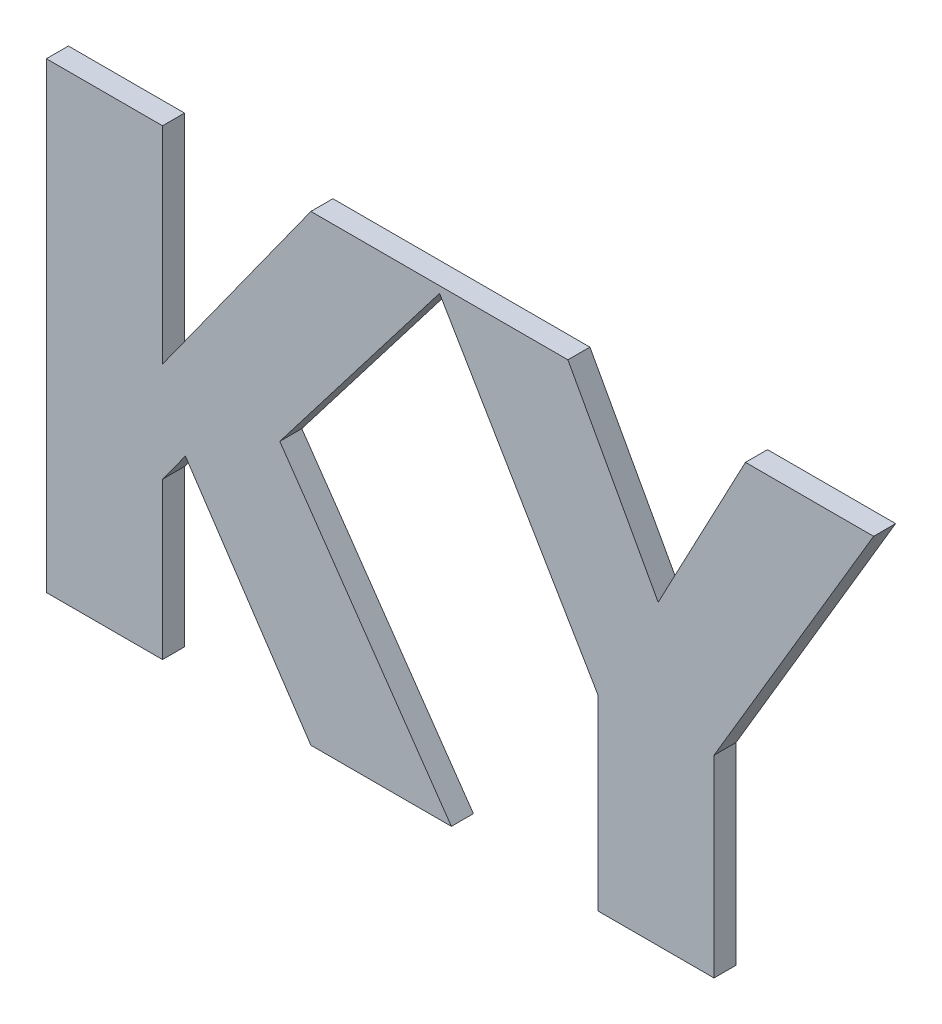
ISO-10303-21;
HEADER;
FILE_DESCRIPTION(('STEP AP214'),'2;1');
FILE_NAME('part.step','',(''),(''),'','','');
FILE_SCHEMA(('AUTOMOTIVE_DESIGN { 1 0 10303 214 1 1 1 1 }'));
ENDSEC;
DATA;
#1=APPLICATION_CONTEXT('core data for automotive mechanical design processes');
#2=APPLICATION_PROTOCOL_DEFINITION('international standard','automotive_design',2000,#1);
#3=PRODUCT_CONTEXT('',#1,'mechanical');
#4=PRODUCT('Part','Part','',(#3));
#5=PRODUCT_RELATED_PRODUCT_CATEGORY('part','',(#4));
#6=PRODUCT_DEFINITION_FORMATION('','',#4);
#7=PRODUCT_DEFINITION_CONTEXT('part definition',#1,'design');
#8=PRODUCT_DEFINITION('design','',#6,#7);
#9=PRODUCT_DEFINITION_SHAPE('','',#8);
#10=(LENGTH_UNIT() NAMED_UNIT(*) SI_UNIT(.MILLI.,.METRE.));
#11=(NAMED_UNIT(*) PLANE_ANGLE_UNIT() SI_UNIT($,.RADIAN.));
#12=(NAMED_UNIT(*) SI_UNIT($,.STERADIAN.) SOLID_ANGLE_UNIT());
#13=UNCERTAINTY_MEASURE_WITH_UNIT(LENGTH_MEASURE(1.E-05),#10,'distance_accuracy_value','');
#14=(GEOMETRIC_REPRESENTATION_CONTEXT(3) GLOBAL_UNCERTAINTY_ASSIGNED_CONTEXT((#13)) GLOBAL_UNIT_ASSIGNED_CONTEXT((#10,
#11,#12)) REPRESENTATION_CONTEXT('',''));
#15=CARTESIAN_POINT('',(0.,0.,0.));
#16=DIRECTION('',(0.,0.,1.));
#17=DIRECTION('',(1.,0.,0.));
#18=AXIS2_PLACEMENT_3D('',#15,#16,#17);
#19=CARTESIAN_POINT('',(3.4840205017097,-3.1855080441471,0.0475));
#20=DIRECTION('',(1.,0.,0.));
#21=DIRECTION('',(0.,1.,0.));
#22=AXIS2_PLACEMENT_3D('',#19,#20,#21);
#23=PLANE('',#22);
#24=DIRECTION('',(0.,-1.,0.));
#25=VECTOR('',#24,1.);
#26=CARTESIAN_POINT('',(3.4840205017097,-3.1416871378978,0.0475));
#27=LINE('',#26,#25);
#28=CARTESIAN_POINT('',(3.4840205017097,-3.1416871378978,0.0475));
#29=VERTEX_POINT('',#28);
#30=CARTESIAN_POINT('',(3.4840205017097,-3.1855080441471,0.0475));
#31=VERTEX_POINT('',#30);
#32=EDGE_CURVE('E11',#29,#31,#27,.T.);
#33=ORIENTED_EDGE('',*,*,#32,.F.);
#34=DIRECTION('',(0.,0.,1.));
#35=VECTOR('',#34,1.);
#36=CARTESIAN_POINT('',(3.4840205017097,-3.1416871378978,0.0475));
#37=LINE('',#36,#35);
#38=CARTESIAN_POINT('',(3.4840205017097,-3.1416871378978,0.0525));
#39=VERTEX_POINT('',#38);
#40=EDGE_CURVE('E24',#29,#39,#37,.T.);
#41=ORIENTED_EDGE('',*,*,#40,.T.);
#42=DIRECTION('',(0.,1.,0.));
#43=VECTOR('',#42,1.);
#44=CARTESIAN_POINT('',(3.4840205017097,-3.1416871378978,0.0525));
#45=LINE('',#44,#43);
#46=CARTESIAN_POINT('',(3.4840205017097,-3.1855080441471,0.0525));
#47=VERTEX_POINT('',#46);
#48=EDGE_CURVE('E311',#47,#39,#45,.T.);
#49=ORIENTED_EDGE('',*,*,#48,.F.);
#50=DIRECTION('',(0.,0.,1.));
#51=VECTOR('',#50,1.);
#52=CARTESIAN_POINT('',(3.4840205017097,-3.1855080441471,0.0475));
#53=LINE('',#52,#51);
#54=EDGE_CURVE('E308',#31,#47,#53,.T.);
#55=ORIENTED_EDGE('',*,*,#54,.F.);
#56=EDGE_LOOP('',(#33,#41,#49,#55));
#57=FACE_BOUND('',#56,.T.);
#58=ADVANCED_FACE('F17',(#57),#23,.T.);
#59=CARTESIAN_POINT('',(3.4576428688218,-3.1855080441471,0.0475));
#60=DIRECTION('',(0.,-1.,0.));
#61=DIRECTION('',(1.,0.,0.));
#62=AXIS2_PLACEMENT_3D('',#59,#60,#61);
#63=PLANE('',#62);
#64=DIRECTION('',(-1.,0.,0.));
#65=VECTOR('',#64,1.);
#66=CARTESIAN_POINT('',(3.4840205017097,-3.1855080441471,0.0475));
#67=LINE('',#66,#65);
#68=CARTESIAN_POINT('',(3.4576428688218,-3.1855080441471,0.0475));
#69=VERTEX_POINT('',#68);
#70=EDGE_CURVE('E306',#31,#69,#67,.T.);
#71=ORIENTED_EDGE('',*,*,#70,.F.);
#72=ORIENTED_EDGE('',*,*,#54,.T.);
#73=DIRECTION('',(1.,0.,0.));
#74=VECTOR('',#73,1.);
#75=CARTESIAN_POINT('',(3.4840205017097,-3.1855080441471,0.0525));
#76=LINE('',#75,#74);
#77=CARTESIAN_POINT('',(3.4576428688218,-3.1855080441471,0.0525));
#78=VERTEX_POINT('',#77);
#79=EDGE_CURVE('E303',#78,#47,#76,.T.);
#80=ORIENTED_EDGE('',*,*,#79,.F.);
#81=DIRECTION('',(0.,0.,1.));
#82=VECTOR('',#81,1.);
#83=CARTESIAN_POINT('',(3.4576428688218,-3.1855080441471,0.0475));
#84=LINE('',#83,#82);
#85=EDGE_CURVE('E300',#69,#78,#84,.T.);
#86=ORIENTED_EDGE('',*,*,#85,.F.);
#87=EDGE_LOOP('',(#71,#72,#80,#86));
#88=FACE_BOUND('',#87,.T.);
#89=ADVANCED_FACE('F379',(#88),#63,.T.);
#90=CARTESIAN_POINT('',(3.4576428688218,-3.142963474973,0.0475));
#91=DIRECTION('',(-1.,0.,0.));
#92=DIRECTION('',(0.,-1.,0.));
#93=AXIS2_PLACEMENT_3D('',#90,#91,#92);
#94=PLANE('',#93);
#95=DIRECTION('',(0.,1.,0.));
#96=VECTOR('',#95,1.);
#97=CARTESIAN_POINT('',(3.4576428688218,-3.1855080441471,0.0475));
#98=LINE('',#97,#96);
#99=CARTESIAN_POINT('',(3.4576428688218,-3.142963474973,0.0475));
#100=VERTEX_POINT('',#99);
#101=EDGE_CURVE('E298',#69,#100,#98,.T.);
#102=ORIENTED_EDGE('',*,*,#101,.F.);
#103=ORIENTED_EDGE('',*,*,#85,.T.);
#104=DIRECTION('',(0.,-1.,0.));
#105=VECTOR('',#104,1.);
#106=CARTESIAN_POINT('',(3.4576428688218,-3.1855080441471,0.0525));
#107=LINE('',#106,#105);
#108=CARTESIAN_POINT('',(3.4576428688218,-3.142963474973,0.0525));
#109=VERTEX_POINT('',#108);
#110=EDGE_CURVE('E295',#109,#78,#107,.T.);
#111=ORIENTED_EDGE('',*,*,#110,.F.);
#112=DIRECTION('',(0.,0.,1.));
#113=VECTOR('',#112,1.);
#114=CARTESIAN_POINT('',(3.4576428688218,-3.142963474973,0.0475));
#115=LINE('',#114,#113);
#116=EDGE_CURVE('E292',#100,#109,#115,.T.);
#117=ORIENTED_EDGE('',*,*,#116,.F.);
#118=EDGE_LOOP('',(#102,#103,#111,#117));
#119=FACE_BOUND('',#118,.T.);
#120=ADVANCED_FACE('F375',(#119),#94,.T.);
#121=CARTESIAN_POINT('',(3.420799271917,-3.0805080474254,0.0475));
#122=DIRECTION('',(-0.861300069403589,-0.508096634947894,0.));
#123=DIRECTION('',(0.508096634947894,-0.861300069403589,0.));
#124=AXIS2_PLACEMENT_3D('',#121,#122,#123);
#125=PLANE('',#124);
#126=DIRECTION('',(0.,0.,1.));
#127=VECTOR('',#126,1.);
#128=CARTESIAN_POINT('',(3.4216865082135,-3.0820120461359,0.0475));
#129=LINE('',#128,#127);
#130=CARTESIAN_POINT('',(3.4216865082135,-3.0820120461359,0.0475));
#131=VERTEX_POINT('',#130);
#132=CARTESIAN_POINT('',(3.4216865082135,-3.0820120461359,0.0525));
#133=VERTEX_POINT('',#132);
#134=EDGE_CURVE('E290',#131,#133,#129,.T.);
#135=ORIENTED_EDGE('',*,*,#134,.F.);
#136=DIRECTION('',(-0.508096634947894,0.861300069403589,0.));
#137=VECTOR('',#136,1.);
#138=CARTESIAN_POINT('',(3.4576428688218,-3.142963474973,0.0475));
#139=LINE('',#138,#137);
#140=EDGE_CURVE('E287',#100,#131,#139,.T.);
#141=ORIENTED_EDGE('',*,*,#140,.F.);
#142=ORIENTED_EDGE('',*,*,#116,.T.);
#143=DIRECTION('',(0.508096634947894,-0.861300069403589,0.));
#144=VECTOR('',#143,1.);
#145=CARTESIAN_POINT('',(3.4576428688218,-3.142963474973,0.0525));
#146=LINE('',#145,#144);
#147=EDGE_CURVE('E284',#133,#109,#146,.T.);
#148=ORIENTED_EDGE('',*,*,#147,.F.);
#149=EDGE_LOOP('',(#135,#141,#142,#148));
#150=FACE_BOUND('',#149,.T.);
#151=ADVANCED_FACE('F371',(#150),#125,.T.);
#152=CARTESIAN_POINT('',(3.4713422200958,-3.1179472682986,0.0475));
#153=DIRECTION('',(0.877056276905158,0.480387642577599,0.));
#154=DIRECTION('',(-0.480387642577599,0.877056276905158,0.));
#155=AXIS2_PLACEMENT_3D('',#152,#153,#154);
#156=PLANE('',#155);
#157=DIRECTION('',(0.480387642577599,-0.877056276905158,0.));
#158=VECTOR('',#157,1.);
#159=CARTESIAN_POINT('',(3.4508357377539,-3.0805080474254,0.0475));
#160=LINE('',#159,#158);
#161=CARTESIAN_POINT('',(3.4508357377539,-3.0805080474254,0.0475));
#162=VERTEX_POINT('',#161);
#163=CARTESIAN_POINT('',(3.4713422200958,-3.1179472682986,0.0475));
#164=VERTEX_POINT('',#163);
#165=EDGE_CURVE('E282',#162,#164,#160,.T.);
#166=ORIENTED_EDGE('',*,*,#165,.F.);
#167=DIRECTION('',(0.,0.,1.));
#168=VECTOR('',#167,1.);
#169=CARTESIAN_POINT('',(3.4508357377539,-3.0805080474254,0.0475));
#170=LINE('',#169,#168);
#171=CARTESIAN_POINT('',(3.4508357377539,-3.0805080474254,0.0525));
#172=VERTEX_POINT('',#171);
#173=EDGE_CURVE('E280',#162,#172,#170,.T.);
#174=ORIENTED_EDGE('',*,*,#173,.T.);
#175=DIRECTION('',(-0.480387642577599,0.877056276905158,0.));
#176=VECTOR('',#175,1.);
#177=CARTESIAN_POINT('',(3.4508357377539,-3.0805080474254,0.0525));
#178=LINE('',#177,#176);
#179=CARTESIAN_POINT('',(3.4713422200958,-3.1179472682986,0.0525));
#180=VERTEX_POINT('',#179);
#181=EDGE_CURVE('E277',#180,#172,#178,.T.);
#182=ORIENTED_EDGE('',*,*,#181,.F.);
#183=DIRECTION('',(0.,0.,1.));
#184=VECTOR('',#183,1.);
#185=CARTESIAN_POINT('',(3.4713422200958,-3.1179472682986,0.0475));
#186=LINE('',#185,#184);
#187=EDGE_CURVE('E274',#164,#180,#186,.T.);
#188=ORIENTED_EDGE('',*,*,#187,.F.);
#189=EDGE_LOOP('',(#166,#174,#182,#188));
#190=FACE_BOUND('',#189,.T.);
#191=ADVANCED_FACE('F328',(#190),#156,.T.);
#192=CARTESIAN_POINT('',(3.491167989331,-3.0805080474254,0.0475));
#193=DIRECTION('',(-0.883739056175919,0.467980000202248,0.));
#194=DIRECTION('',(-0.467980000202248,-0.883739056175919,0.));
#195=AXIS2_PLACEMENT_3D('',#192,#193,#194);
#196=PLANE('',#195);
#197=DIRECTION('',(0.467980000202248,0.883739056175919,0.));
#198=VECTOR('',#197,1.);
#199=CARTESIAN_POINT('',(3.4713422200958,-3.1179472682986,0.0475));
#200=LINE('',#199,#198);
#201=CARTESIAN_POINT('',(3.491167989331,-3.0805080474254,0.0475));
#202=VERTEX_POINT('',#201);
#203=EDGE_CURVE('E272',#164,#202,#200,.T.);
#204=ORIENTED_EDGE('',*,*,#203,.F.);
#205=ORIENTED_EDGE('',*,*,#187,.T.);
#206=DIRECTION('',(-0.467980000202248,-0.883739056175919,0.));
#207=VECTOR('',#206,1.);
#208=CARTESIAN_POINT('',(3.4713422200958,-3.1179472682986,0.0525));
#209=LINE('',#208,#207);
#210=CARTESIAN_POINT('',(3.491167989331,-3.0805080474254,0.0525));
#211=VERTEX_POINT('',#210);
#212=EDGE_CURVE('E269',#211,#180,#209,.T.);
#213=ORIENTED_EDGE('',*,*,#212,.F.);
#214=DIRECTION('',(0.,0.,1.));
#215=VECTOR('',#214,1.);
#216=CARTESIAN_POINT('',(3.491167989331,-3.0805080474254,0.0475));
#217=LINE('',#216,#215);
#218=EDGE_CURVE('E266',#202,#211,#217,.T.);
#219=ORIENTED_EDGE('',*,*,#218,.F.);
#220=EDGE_LOOP('',(#204,#205,#213,#219));
#221=FACE_BOUND('',#220,.T.);
#222=ADVANCED_FACE('F325',(#221),#196,.T.);
#223=CARTESIAN_POINT('',(3.5202684746461,-3.0805080474254,0.0475));
#224=DIRECTION('',(0.,1.,0.));
#225=DIRECTION('',(-1.,0.,0.));
#226=AXIS2_PLACEMENT_3D('',#223,#224,#225);
#227=PLANE('',#226);
#228=DIRECTION('',(1.,0.,0.));
#229=VECTOR('',#228,1.);
#230=CARTESIAN_POINT('',(3.491167989331,-3.0805080474254,0.0475));
#231=LINE('',#230,#229);
#232=CARTESIAN_POINT('',(3.5202684746461,-3.0805080474254,0.0475));
#233=VERTEX_POINT('',#232);
#234=EDGE_CURVE('E264',#202,#233,#231,.T.);
#235=ORIENTED_EDGE('',*,*,#234,.F.);
#236=ORIENTED_EDGE('',*,*,#218,.T.);
#237=DIRECTION('',(-1.,0.,0.));
#238=VECTOR('',#237,1.);
#239=CARTESIAN_POINT('',(3.491167989331,-3.0805080474254,0.0525));
#240=LINE('',#239,#238);
#241=CARTESIAN_POINT('',(3.5202684746461,-3.0805080474254,0.0525));
#242=VERTEX_POINT('',#241);
#243=EDGE_CURVE('E261',#242,#211,#240,.T.);
#244=ORIENTED_EDGE('',*,*,#243,.F.);
#245=DIRECTION('',(0.,0.,1.));
#246=VECTOR('',#245,1.);
#247=CARTESIAN_POINT('',(3.5202684746461,-3.0805080474254,0.0475));
#248=LINE('',#247,#246);
#249=EDGE_CURVE('E258',#233,#242,#248,.T.);
#250=ORIENTED_EDGE('',*,*,#249,.F.);
#251=EDGE_LOOP('',(#235,#236,#244,#250));
#252=FACE_BOUND('',#251,.T.);
#253=ADVANCED_FACE('F320',(#252),#227,.T.);
#254=CARTESIAN_POINT('',(3.4840205017097,-3.1416871378978,0.0475));
#255=DIRECTION('',(0.860330404318498,-0.509736790319444,0.));
#256=DIRECTION('',(0.509736790319444,0.860330404318498,0.));
#257=AXIS2_PLACEMENT_3D('',#254,#255,#256);
#258=PLANE('',#257);
#259=DIRECTION('',(-0.509736790319444,-0.860330404318498,0.));
#260=VECTOR('',#259,1.);
#261=CARTESIAN_POINT('',(3.5202684746461,-3.0805080474254,0.0475));
#262=LINE('',#261,#260);
#263=EDGE_CURVE('E256',#233,#29,#262,.T.);
#264=ORIENTED_EDGE('',*,*,#263,.F.);
#265=ORIENTED_EDGE('',*,*,#249,.T.);
#266=DIRECTION('',(0.509736790319444,0.860330404318498,0.));
#267=VECTOR('',#266,1.);
#268=CARTESIAN_POINT('',(3.5202684746461,-3.0805080474254,0.0525));
#269=LINE('',#268,#267);
#270=EDGE_CURVE('E253',#39,#242,#269,.T.);
#271=ORIENTED_EDGE('',*,*,#270,.F.);
#272=ORIENTED_EDGE('',*,*,#40,.F.);
#273=EDGE_LOOP('',(#264,#265,#271,#272));
#274=FACE_BOUND('',#273,.T.);
#275=ADVANCED_FACE('F316',(#274),#258,.T.);
#276=CARTESIAN_POINT('',(3.3854021903641,-3.1292641236989,0.0475));
#277=DIRECTION('',(0.793138273917805,-0.609041606498838,0.));
#278=DIRECTION('',(0.609041606498838,0.793138273917805,0.));
#279=AXIS2_PLACEMENT_3D('',#276,#277,#278);
#280=PLANE('',#279);
#281=ORIENTED_EDGE('',*,*,#134,.T.);
#282=DIRECTION('',(0.609041606498838,0.793138273917805,0.));
#283=VECTOR('',#282,1.);
#284=CARTESIAN_POINT('',(3.4228414112373,-3.0805080474254,0.0525));
#285=LINE('',#284,#283);
#286=CARTESIAN_POINT('',(3.3854021903641,-3.1292641236989,0.0525));
#287=VERTEX_POINT('',#286);
#288=EDGE_CURVE('E251',#287,#133,#285,.T.);
#289=ORIENTED_EDGE('',*,*,#288,.F.);
#290=DIRECTION('',(0.,0.,1.));
#291=VECTOR('',#290,1.);
#292=CARTESIAN_POINT('',(3.3854021903641,-3.1292641236989,0.0475));
#293=LINE('',#292,#291);
#294=CARTESIAN_POINT('',(3.3854021903641,-3.1292641236989,0.0475));
#295=VERTEX_POINT('',#294);
#296=EDGE_CURVE('E156',#295,#287,#293,.T.);
#297=ORIENTED_EDGE('',*,*,#296,.F.);
#298=DIRECTION('',(-0.609041606498838,-0.793138273917805,0.));
#299=VECTOR('',#298,1.);
#300=CARTESIAN_POINT('',(3.4228414112373,-3.0805080474254,0.0475));
#301=LINE('',#300,#299);
#302=EDGE_CURVE('E247',#131,#295,#301,.T.);
#303=ORIENTED_EDGE('',*,*,#302,.F.);
#304=EDGE_LOOP('',(#281,#289,#297,#303));
#305=FACE_BOUND('',#304,.T.);
#306=ADVANCED_FACE('F368',(#305),#280,.T.);
#307=CARTESIAN_POINT('',(3.4228414112373,-3.0805080474254,0.0475));
#308=DIRECTION('',(0.,1.,0.));
#309=DIRECTION('',(-1.,0.,0.));
#310=AXIS2_PLACEMENT_3D('',#307,#308,#309);
#311=PLANE('',#310);
#312=DIRECTION('',(1.,0.,0.));
#313=VECTOR('',#312,1.);
#314=CARTESIAN_POINT('',(3.392464588847,-3.0805080474254,0.0475));
#315=LINE('',#314,#313);
#316=CARTESIAN_POINT('',(3.392464588847,-3.0805080474254,0.0475));
#317=VERTEX_POINT('',#316);
#318=EDGE_CURVE('E244',#317,#162,#315,.T.);
#319=ORIENTED_EDGE('',*,*,#318,.F.);
#320=DIRECTION('',(0.,0.,1.));
#321=VECTOR('',#320,1.);
#322=CARTESIAN_POINT('',(3.392464588847,-3.0805080474254,0.0475));
#323=LINE('',#322,#321);
#324=CARTESIAN_POINT('',(3.392464588847,-3.0805080474254,0.0525));
#325=VERTEX_POINT('',#324);
#326=EDGE_CURVE('E242',#317,#325,#323,.T.);
#327=ORIENTED_EDGE('',*,*,#326,.T.);
#328=DIRECTION('',(-1.,0.,0.));
#329=VECTOR('',#328,1.);
#330=CARTESIAN_POINT('',(3.420799271917,-3.0805080474254,0.0525));
#331=LINE('',#330,#329);
#332=EDGE_CURVE('E240',#172,#325,#331,.T.);
#333=ORIENTED_EDGE('',*,*,#332,.F.);
#334=ORIENTED_EDGE('',*,*,#173,.F.);
#335=EDGE_LOOP('',(#319,#327,#333,#334));
#336=FACE_BOUND('',#335,.T.);
#337=ADVANCED_FACE('F331',(#336),#311,.T.);
#338=CARTESIAN_POINT('',(3.3639597275003,-3.1428783858346,0.0475));
#339=DIRECTION('',(-0.831283694214455,-0.555848378366951,0.));
#340=DIRECTION('',(0.555848378366951,-0.831283694214455,0.));
#341=AXIS2_PLACEMENT_3D('',#338,#339,#340);
#342=PLANE('',#341);
#343=DIRECTION('',(-0.555848378366951,0.831283694214455,0.));
#344=VECTOR('',#343,1.);
#345=CARTESIAN_POINT('',(3.392464588847,-3.1855080441471,0.0475));
#346=LINE('',#345,#344);
#347=CARTESIAN_POINT('',(3.392464588847,-3.1855080441471,0.0475));
#348=VERTEX_POINT('',#347);
#349=CARTESIAN_POINT('',(3.3639597275003,-3.1428783858346,0.0475));
#350=VERTEX_POINT('',#349);
#351=EDGE_CURVE('E238',#348,#350,#346,.T.);
#352=ORIENTED_EDGE('',*,*,#351,.F.);
#353=DIRECTION('',(0.,0.,1.));
#354=VECTOR('',#353,1.);
#355=CARTESIAN_POINT('',(3.392464588847,-3.1855080441471,0.0475));
#356=LINE('',#355,#354);
#357=CARTESIAN_POINT('',(3.392464588847,-3.1855080441471,0.0525));
#358=VERTEX_POINT('',#357);
#359=EDGE_CURVE('E236',#348,#358,#356,.T.);
#360=ORIENTED_EDGE('',*,*,#359,.T.);
#361=DIRECTION('',(0.555848378366951,-0.831283694214455,0.));
#362=VECTOR('',#361,1.);
#363=CARTESIAN_POINT('',(3.392464588847,-3.1855080441471,0.0525));
#364=LINE('',#363,#362);
#365=CARTESIAN_POINT('',(3.3639597275003,-3.1428783858346,0.0525));
#366=VERTEX_POINT('',#365);
#367=EDGE_CURVE('E174',#366,#358,#364,.T.);
#368=ORIENTED_EDGE('',*,*,#367,.F.);
#369=DIRECTION('',(0.,0.,1.));
#370=VECTOR('',#369,1.);
#371=CARTESIAN_POINT('',(3.3639597275003,-3.1428783858346,0.0475));
#372=LINE('',#371,#370);
#373=EDGE_CURVE('E232',#350,#366,#372,.T.);
#374=ORIENTED_EDGE('',*,*,#373,.F.);
#375=EDGE_LOOP('',(#352,#360,#368,#374));
#376=FACE_BOUND('',#375,.T.);
#377=ADVANCED_FACE('F364',(#376),#342,.T.);
#378=CARTESIAN_POINT('',(3.3587692900611,-3.1500258734559,0.0475));
#379=DIRECTION('',(0.809152433574183,-0.58759879104792,0.));
#380=DIRECTION('',(0.58759879104792,0.809152433574183,0.));
#381=AXIS2_PLACEMENT_3D('',#378,#379,#380);
#382=PLANE('',#381);
#383=DIRECTION('',(-0.58759879104792,-0.809152433574183,0.));
#384=VECTOR('',#383,1.);
#385=CARTESIAN_POINT('',(3.3639597275003,-3.1428783858346,0.0475));
#386=LINE('',#385,#384);
#387=CARTESIAN_POINT('',(3.3587692900611,-3.1500258734559,0.0475));
#388=VERTEX_POINT('',#387);
#389=EDGE_CURVE('E230',#350,#388,#386,.T.);
#390=ORIENTED_EDGE('',*,*,#389,.F.);
#391=ORIENTED_EDGE('',*,*,#373,.T.);
#392=DIRECTION('',(0.58759879104792,0.809152433574183,0.));
#393=VECTOR('',#392,1.);
#394=CARTESIAN_POINT('',(3.3639597275003,-3.1428783858346,0.0525));
#395=LINE('',#394,#393);
#396=CARTESIAN_POINT('',(3.3587692900611,-3.1500258734559,0.0525));
#397=VERTEX_POINT('',#396);
#398=EDGE_CURVE('E228',#397,#366,#395,.T.);
#399=ORIENTED_EDGE('',*,*,#398,.F.);
#400=DIRECTION('',(0.,0.,1.));
#401=VECTOR('',#400,1.);
#402=CARTESIAN_POINT('',(3.3587692900611,-3.1500258734559,0.0475));
#403=LINE('',#402,#401);
#404=EDGE_CURVE('E225',#388,#397,#403,.T.);
#405=ORIENTED_EDGE('',*,*,#404,.F.);
#406=EDGE_LOOP('',(#390,#391,#399,#405));
#407=FACE_BOUND('',#406,.T.);
#408=ADVANCED_FACE('F361',(#407),#382,.T.);
#409=CARTESIAN_POINT('',(3.3587692900611,-3.1855080441471,0.0475));
#410=DIRECTION('',(1.,0.,0.));
#411=DIRECTION('',(0.,1.,0.));
#412=AXIS2_PLACEMENT_3D('',#409,#410,#411);
#413=PLANE('',#412);
#414=DIRECTION('',(0.,-1.,0.));
#415=VECTOR('',#414,1.);
#416=CARTESIAN_POINT('',(3.3587692900611,-3.1500258734559,0.0475));
#417=LINE('',#416,#415);
#418=CARTESIAN_POINT('',(3.3587692900611,-3.1855080441471,0.0475));
#419=VERTEX_POINT('',#418);
#420=EDGE_CURVE('E223',#388,#419,#417,.T.);
#421=ORIENTED_EDGE('',*,*,#420,.F.);
#422=ORIENTED_EDGE('',*,*,#404,.T.);
#423=DIRECTION('',(0.,1.,0.));
#424=VECTOR('',#423,1.);
#425=CARTESIAN_POINT('',(3.3587692900611,-3.1500258734559,0.0525));
#426=LINE('',#425,#424);
#427=CARTESIAN_POINT('',(3.3587692900611,-3.1855080441471,0.0525));
#428=VERTEX_POINT('',#427);
#429=EDGE_CURVE('E220',#428,#397,#426,.T.);
#430=ORIENTED_EDGE('',*,*,#429,.F.);
#431=DIRECTION('',(0.,0.,1.));
#432=VECTOR('',#431,1.);
#433=CARTESIAN_POINT('',(3.3587692900611,-3.1855080441471,0.0475));
#434=LINE('',#433,#432);
#435=EDGE_CURVE('E217',#419,#428,#434,.T.);
#436=ORIENTED_EDGE('',*,*,#435,.F.);
#437=EDGE_LOOP('',(#421,#422,#430,#436));
#438=FACE_BOUND('',#437,.T.);
#439=ADVANCED_FACE('F357',(#438),#413,.T.);
#440=CARTESIAN_POINT('',(3.3323916571731,-3.1855080441471,0.0475));
#441=DIRECTION('',(0.,-1.,0.));
#442=DIRECTION('',(1.,0.,0.));
#443=AXIS2_PLACEMENT_3D('',#440,#441,#442);
#444=PLANE('',#443);
#445=DIRECTION('',(-1.,0.,0.));
#446=VECTOR('',#445,1.);
#447=CARTESIAN_POINT('',(3.3587692900611,-3.1855080441471,0.0475));
#448=LINE('',#447,#446);
#449=CARTESIAN_POINT('',(3.3323916571731,-3.1855080441471,0.0475));
#450=VERTEX_POINT('',#449);
#451=EDGE_CURVE('E215',#419,#450,#448,.T.);
#452=ORIENTED_EDGE('',*,*,#451,.F.);
#453=ORIENTED_EDGE('',*,*,#435,.T.);
#454=DIRECTION('',(1.,0.,0.));
#455=VECTOR('',#454,1.);
#456=CARTESIAN_POINT('',(3.3587692900611,-3.1855080441471,0.0525));
#457=LINE('',#456,#455);
#458=CARTESIAN_POINT('',(3.3323916571731,-3.1855080441471,0.0525));
#459=VERTEX_POINT('',#458);
#460=EDGE_CURVE('E212',#459,#428,#457,.T.);
#461=ORIENTED_EDGE('',*,*,#460,.F.);
#462=DIRECTION('',(0.,0.,1.));
#463=VECTOR('',#462,1.);
#464=CARTESIAN_POINT('',(3.3323916571731,-3.1855080441471,0.0475));
#465=LINE('',#464,#463);
#466=EDGE_CURVE('E209',#450,#459,#465,.T.);
#467=ORIENTED_EDGE('',*,*,#466,.F.);
#468=EDGE_LOOP('',(#452,#453,#461,#467));
#469=FACE_BOUND('',#468,.T.);
#470=ADVANCED_FACE('F353',(#469),#444,.T.);
#471=CARTESIAN_POINT('',(3.3323916571731,-3.0805080474254,0.0475));
#472=DIRECTION('',(-1.,0.,0.));
#473=DIRECTION('',(0.,-1.,0.));
#474=AXIS2_PLACEMENT_3D('',#471,#472,#473);
#475=PLANE('',#474);
#476=DIRECTION('',(0.,1.,0.));
#477=VECTOR('',#476,1.);
#478=CARTESIAN_POINT('',(3.3323916571731,-3.1855080441471,0.0475));
#479=LINE('',#478,#477);
#480=CARTESIAN_POINT('',(3.3323916571731,-3.0805080474254,0.0475));
#481=VERTEX_POINT('',#480);
#482=EDGE_CURVE('E207',#450,#481,#479,.T.);
#483=ORIENTED_EDGE('',*,*,#482,.F.);
#484=ORIENTED_EDGE('',*,*,#466,.T.);
#485=DIRECTION('',(0.,-1.,0.));
#486=VECTOR('',#485,1.);
#487=CARTESIAN_POINT('',(3.3323916571731,-3.1855080441471,0.0525));
#488=LINE('',#487,#486);
#489=CARTESIAN_POINT('',(3.3323916571731,-3.0805080474254,0.0525));
#490=VERTEX_POINT('',#489);
#491=EDGE_CURVE('E204',#490,#459,#488,.T.);
#492=ORIENTED_EDGE('',*,*,#491,.F.);
#493=DIRECTION('',(0.,0.,1.));
#494=VECTOR('',#493,1.);
#495=CARTESIAN_POINT('',(3.3323916571731,-3.0805080474254,0.0475));
#496=LINE('',#495,#494);
#497=EDGE_CURVE('E201',#481,#490,#496,.T.);
#498=ORIENTED_EDGE('',*,*,#497,.F.);
#499=EDGE_LOOP('',(#483,#484,#492,#498));
#500=FACE_BOUND('',#499,.T.);
#501=ADVANCED_FACE('F349',(#500),#475,.T.);
#502=CARTESIAN_POINT('',(3.3587692900611,-3.0805080474254,0.0475));
#503=DIRECTION('',(0.,1.,0.));
#504=DIRECTION('',(-1.,0.,0.));
#505=AXIS2_PLACEMENT_3D('',#502,#503,#504);
#506=PLANE('',#505);
#507=DIRECTION('',(1.,0.,0.));
#508=VECTOR('',#507,1.);
#509=CARTESIAN_POINT('',(3.3323916571731,-3.0805080474254,0.0475));
#510=LINE('',#509,#508);
#511=CARTESIAN_POINT('',(3.3587692900611,-3.0805080474254,0.0475));
#512=VERTEX_POINT('',#511);
#513=EDGE_CURVE('E199',#481,#512,#510,.T.);
#514=ORIENTED_EDGE('',*,*,#513,.F.);
#515=ORIENTED_EDGE('',*,*,#497,.T.);
#516=DIRECTION('',(-1.,0.,0.));
#517=VECTOR('',#516,1.);
#518=CARTESIAN_POINT('',(3.3323916571731,-3.0805080474254,0.0525));
#519=LINE('',#518,#517);
#520=CARTESIAN_POINT('',(3.3587692900611,-3.0805080474254,0.0525));
#521=VERTEX_POINT('',#520);
#522=EDGE_CURVE('E196',#521,#490,#519,.T.);
#523=ORIENTED_EDGE('',*,*,#522,.F.);
#524=DIRECTION('',(0.,0.,1.));
#525=VECTOR('',#524,1.);
#526=CARTESIAN_POINT('',(3.3587692900611,-3.0805080474254,0.0475));
#527=LINE('',#526,#525);
#528=EDGE_CURVE('E193',#512,#521,#527,.T.);
#529=ORIENTED_EDGE('',*,*,#528,.F.);
#530=EDGE_LOOP('',(#514,#515,#523,#529));
#531=FACE_BOUND('',#530,.T.);
#532=ADVANCED_FACE('F345',(#531),#506,.T.);
#533=CARTESIAN_POINT('',(3.3587692900611,-3.1273921626552,0.0475));
#534=DIRECTION('',(1.,0.,0.));
#535=DIRECTION('',(0.,1.,0.));
#536=AXIS2_PLACEMENT_3D('',#533,#534,#535);
#537=PLANE('',#536);
#538=DIRECTION('',(0.,-1.,0.));
#539=VECTOR('',#538,1.);
#540=CARTESIAN_POINT('',(3.3587692900611,-3.0805080474254,0.0475));
#541=LINE('',#540,#539);
#542=CARTESIAN_POINT('',(3.3587692900611,-3.1273921626552,0.0475));
#543=VERTEX_POINT('',#542);
#544=EDGE_CURVE('E191',#512,#543,#541,.T.);
#545=ORIENTED_EDGE('',*,*,#544,.F.);
#546=ORIENTED_EDGE('',*,*,#528,.T.);
#547=DIRECTION('',(0.,1.,0.));
#548=VECTOR('',#547,1.);
#549=CARTESIAN_POINT('',(3.3587692900611,-3.0805080474254,0.0525));
#550=LINE('',#549,#548);
#551=CARTESIAN_POINT('',(3.3587692900611,-3.1273921626552,0.0525));
#552=VERTEX_POINT('',#551);
#553=EDGE_CURVE('E188',#552,#521,#550,.T.);
#554=ORIENTED_EDGE('',*,*,#553,.F.);
#555=DIRECTION('',(0.,0.,1.));
#556=VECTOR('',#555,1.);
#557=CARTESIAN_POINT('',(3.3587692900611,-3.1273921626552,0.0475));
#558=LINE('',#557,#556);
#559=EDGE_CURVE('E185',#543,#552,#558,.T.);
#560=ORIENTED_EDGE('',*,*,#559,.F.);
#561=EDGE_LOOP('',(#545,#546,#554,#560));
#562=FACE_BOUND('',#561,.T.);
#563=ADVANCED_FACE('F341',(#562),#537,.T.);
#564=CARTESIAN_POINT('',(3.392464588847,-3.0805080474254,0.0475));
#565=DIRECTION('',(-0.812037197104277,0.583605680677484,0.));
#566=DIRECTION('',(-0.583605680677484,-0.812037197104277,0.));
#567=AXIS2_PLACEMENT_3D('',#564,#565,#566);
#568=PLANE('',#567);
#569=DIRECTION('',(0.583605680677484,0.812037197104277,0.));
#570=VECTOR('',#569,1.);
#571=CARTESIAN_POINT('',(3.3587692900611,-3.1273921626552,0.0475));
#572=LINE('',#571,#570);
#573=EDGE_CURVE('E182',#543,#317,#572,.T.);
#574=ORIENTED_EDGE('',*,*,#573,.F.);
#575=ORIENTED_EDGE('',*,*,#559,.T.);
#576=DIRECTION('',(-0.583605680677484,-0.812037197104277,0.));
#577=VECTOR('',#576,1.);
#578=CARTESIAN_POINT('',(3.3587692900611,-3.1273921626552,0.0525));
#579=LINE('',#578,#577);
#580=EDGE_CURVE('E179',#325,#552,#579,.T.);
#581=ORIENTED_EDGE('',*,*,#580,.F.);
#582=ORIENTED_EDGE('',*,*,#326,.F.);
#583=EDGE_LOOP('',(#574,#575,#581,#582));
#584=FACE_BOUND('',#583,.T.);
#585=ADVANCED_FACE('F338',(#584),#568,.T.);
#586=CARTESIAN_POINT('',(3.4243730157276,-3.1855080441471,0.0475));
#587=DIRECTION('',(0.821968294045382,0.569533250639614,0.));
#588=DIRECTION('',(-0.569533250639614,0.821968294045382,0.));
#589=AXIS2_PLACEMENT_3D('',#586,#587,#588);
#590=PLANE('',#589);
#591=DIRECTION('',(0.569533250639614,-0.821968294045382,0.));
#592=VECTOR('',#591,1.);
#593=CARTESIAN_POINT('',(3.3854021903641,-3.1292641236989,0.0475));
#594=LINE('',#593,#592);
#595=CARTESIAN_POINT('',(3.4243730157276,-3.1855080441471,0.0475));
#596=VERTEX_POINT('',#595);
#597=EDGE_CURVE('E160',#295,#596,#594,.T.);
#598=ORIENTED_EDGE('',*,*,#597,.F.);
#599=ORIENTED_EDGE('',*,*,#296,.T.);
#600=DIRECTION('',(-0.569533250639614,0.821968294045382,0.));
#601=VECTOR('',#600,1.);
#602=CARTESIAN_POINT('',(3.3854021903641,-3.1292641236989,0.0525));
#603=LINE('',#602,#601);
#604=CARTESIAN_POINT('',(3.4243730157276,-3.1855080441471,0.0525));
#605=VERTEX_POINT('',#604);
#606=EDGE_CURVE('E150',#605,#287,#603,.T.);
#607=ORIENTED_EDGE('',*,*,#606,.F.);
#608=DIRECTION('',(0.,0.,1.));
#609=VECTOR('',#608,1.);
#610=CARTESIAN_POINT('',(3.4243730157276,-3.1855080441471,0.0475));
#611=LINE('',#610,#609);
#612=EDGE_CURVE('E154',#596,#605,#611,.T.);
#613=ORIENTED_EDGE('',*,*,#612,.F.);
#614=EDGE_LOOP('',(#598,#599,#607,#613));
#615=FACE_BOUND('',#614,.T.);
#616=ADVANCED_FACE('F153',(#615),#590,.T.);
#617=CARTESIAN_POINT('',(3.392464588847,-3.1855080441471,0.0475));
#618=DIRECTION('',(0.,-1.,0.));
#619=DIRECTION('',(1.,0.,0.));
#620=AXIS2_PLACEMENT_3D('',#617,#618,#619);
#621=PLANE('',#620);
#622=DIRECTION('',(-1.,0.,0.));
#623=VECTOR('',#622,1.);
#624=CARTESIAN_POINT('',(3.4243730157276,-3.1855080441471,0.0475));
#625=LINE('',#624,#623);
#626=EDGE_CURVE('E168',#596,#348,#625,.T.);
#627=ORIENTED_EDGE('',*,*,#626,.F.);
#628=ORIENTED_EDGE('',*,*,#612,.T.);
#629=DIRECTION('',(1.,0.,0.));
#630=VECTOR('',#629,1.);
#631=CARTESIAN_POINT('',(3.4243730157276,-3.1855080441471,0.0525));
#632=LINE('',#631,#630);
#633=EDGE_CURVE('E166',#358,#605,#632,.T.);
#634=ORIENTED_EDGE('',*,*,#633,.F.);
#635=ORIENTED_EDGE('',*,*,#359,.F.);
#636=EDGE_LOOP('',(#627,#628,#634,#635));
#637=FACE_BOUND('',#636,.T.);
#638=ADVANCED_FACE('F164',(#637),#621,.T.);
#639=CARTESIAN_POINT('',(3.3724745947897,-3.1328826718505,0.0475));
#640=DIRECTION('',(0.,0.,1.));
#641=DIRECTION('',(1.,0.,0.));
#642=AXIS2_PLACEMENT_3D('',#639,#640,#641);
#643=PLANE('',#642);
#644=ORIENTED_EDGE('',*,*,#302,.T.);
#645=ORIENTED_EDGE('',*,*,#597,.T.);
#646=ORIENTED_EDGE('',*,*,#626,.T.);
#647=ORIENTED_EDGE('',*,*,#351,.T.);
#648=ORIENTED_EDGE('',*,*,#389,.T.);
#649=ORIENTED_EDGE('',*,*,#420,.T.);
#650=ORIENTED_EDGE('',*,*,#451,.T.);
#651=ORIENTED_EDGE('',*,*,#482,.T.);
#652=ORIENTED_EDGE('',*,*,#513,.T.);
#653=ORIENTED_EDGE('',*,*,#544,.T.);
#654=ORIENTED_EDGE('',*,*,#573,.T.);
#655=ORIENTED_EDGE('',*,*,#318,.T.);
#656=ORIENTED_EDGE('',*,*,#165,.T.);
#657=ORIENTED_EDGE('',*,*,#203,.T.);
#658=ORIENTED_EDGE('',*,*,#234,.T.);
#659=ORIENTED_EDGE('',*,*,#263,.T.);
#660=ORIENTED_EDGE('',*,*,#32,.T.);
#661=ORIENTED_EDGE('',*,*,#70,.T.);
#662=ORIENTED_EDGE('',*,*,#101,.T.);
#663=ORIENTED_EDGE('',*,*,#140,.T.);
#664=EDGE_LOOP('',(#644,#645,#646,#647,#648,#649,#650,#651,#652,#653,#654,#655,#656,#657,#658,
#659,#660,#661,#662,#663));
#665=FACE_BOUND('',#664,.T.);
#666=ADVANCED_FACE('F333',(#665),#643,.F.);
#667=CARTESIAN_POINT('',(3.3724745947897,-3.1328826718505,0.0525));
#668=DIRECTION('',(0.,0.,1.));
#669=DIRECTION('',(1.,0.,0.));
#670=AXIS2_PLACEMENT_3D('',#667,#668,#669);
#671=PLANE('',#670);
#672=ORIENTED_EDGE('',*,*,#332,.T.);
#673=ORIENTED_EDGE('',*,*,#580,.T.);
#674=ORIENTED_EDGE('',*,*,#553,.T.);
#675=ORIENTED_EDGE('',*,*,#522,.T.);
#676=ORIENTED_EDGE('',*,*,#491,.T.);
#677=ORIENTED_EDGE('',*,*,#460,.T.);
#678=ORIENTED_EDGE('',*,*,#429,.T.);
#679=ORIENTED_EDGE('',*,*,#398,.T.);
#680=ORIENTED_EDGE('',*,*,#367,.T.);
#681=ORIENTED_EDGE('',*,*,#633,.T.);
#682=ORIENTED_EDGE('',*,*,#606,.T.);
#683=ORIENTED_EDGE('',*,*,#288,.T.);
#684=ORIENTED_EDGE('',*,*,#147,.T.);
#685=ORIENTED_EDGE('',*,*,#110,.T.);
#686=ORIENTED_EDGE('',*,*,#79,.T.);
#687=ORIENTED_EDGE('',*,*,#48,.T.);
#688=ORIENTED_EDGE('',*,*,#270,.T.);
#689=ORIENTED_EDGE('',*,*,#243,.T.);
#690=ORIENTED_EDGE('',*,*,#212,.T.);
#691=ORIENTED_EDGE('',*,*,#181,.T.);
#692=EDGE_LOOP('',(#672,#673,#674,#675,#676,#677,#678,#679,#680,#681,#682,#683,#684,#685,#686,
#687,#688,#689,#690,#691));
#693=FACE_BOUND('',#692,.T.);
#694=ADVANCED_FACE('F172',(#693),#671,.T.);
#695=CLOSED_SHELL('',(#58,#89,#120,#151,#191,#222,#253,#275,#306,#337,#377,#408,#439,#470,#501,
#532,#563,#585,#616,#638,#666,#694));
#696=MANIFOLD_SOLID_BREP('B1',#695);
#697=ADVANCED_BREP_SHAPE_REPRESENTATION('',(#18,#696),#14);
#698=SHAPE_DEFINITION_REPRESENTATION(#9,#697);
ENDSEC;
END-ISO-10303-21;
